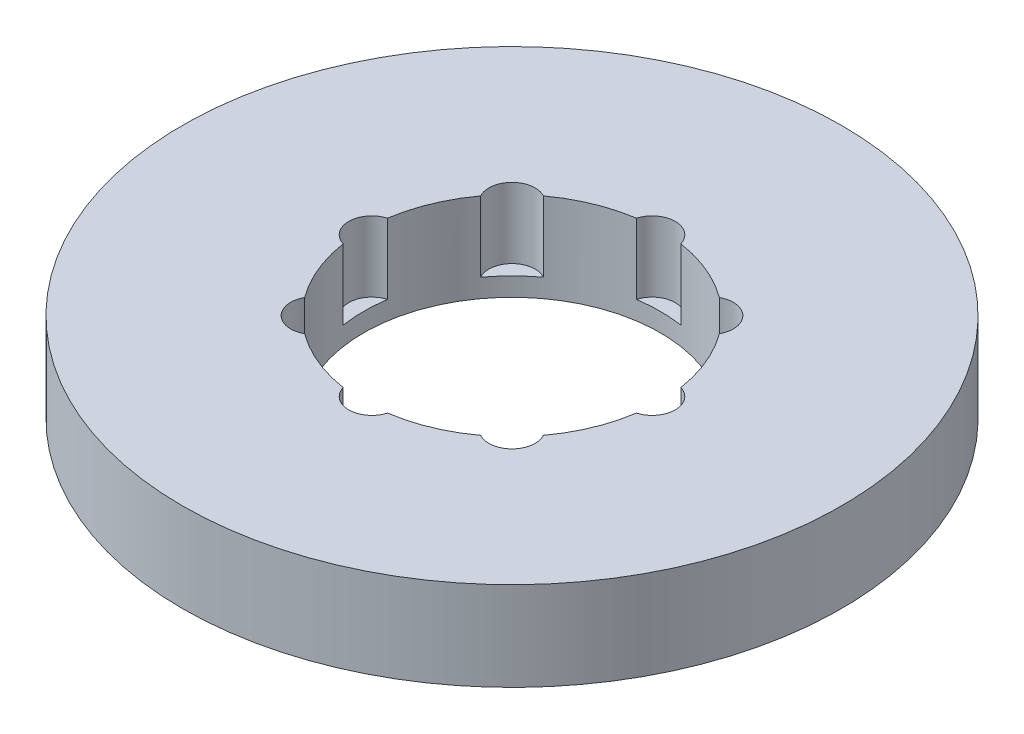
ISO-10303-21;
HEADER;
FILE_DESCRIPTION(('STEP AP214'),'2;1');
FILE_NAME('part.step','',(''),(''),'','','');
FILE_SCHEMA(('AUTOMOTIVE_DESIGN { 1 0 10303 214 1 1 1 1 }'));
ENDSEC;
DATA;
#1=APPLICATION_CONTEXT('core data for automotive mechanical design processes');
#2=APPLICATION_PROTOCOL_DEFINITION('international standard','automotive_design',2000,#1);
#3=PRODUCT_CONTEXT('',#1,'mechanical');
#4=PRODUCT('Part','Part','',(#3));
#5=PRODUCT_RELATED_PRODUCT_CATEGORY('part','',(#4));
#6=PRODUCT_DEFINITION_FORMATION('','',#4);
#7=PRODUCT_DEFINITION_CONTEXT('part definition',#1,'design');
#8=PRODUCT_DEFINITION('design','',#6,#7);
#9=PRODUCT_DEFINITION_SHAPE('','',#8);
#10=(LENGTH_UNIT() NAMED_UNIT(*) SI_UNIT(.MILLI.,.METRE.));
#11=(NAMED_UNIT(*) PLANE_ANGLE_UNIT() SI_UNIT($,.RADIAN.));
#12=(NAMED_UNIT(*) SI_UNIT($,.STERADIAN.) SOLID_ANGLE_UNIT());
#13=UNCERTAINTY_MEASURE_WITH_UNIT(LENGTH_MEASURE(1.E-05),#10,'distance_accuracy_value','');
#14=(GEOMETRIC_REPRESENTATION_CONTEXT(3) GLOBAL_UNCERTAINTY_ASSIGNED_CONTEXT((#13)) GLOBAL_UNIT_ASSIGNED_CONTEXT((#10,
#11,#12)) REPRESENTATION_CONTEXT('',''));
#15=CARTESIAN_POINT('',(0.,0.,0.));
#16=DIRECTION('',(0.,0.,1.));
#17=DIRECTION('',(1.,0.,0.));
#18=AXIS2_PLACEMENT_3D('',#15,#16,#17);
#19=CARTESIAN_POINT('',(0.,27.,0.));
#20=DIRECTION('',(0.,-1.,0.));
#21=DIRECTION('',(0.,0.,-1.));
#22=AXIS2_PLACEMENT_3D('',#19,#20,#21);
#23=CYLINDRICAL_SURFACE('',#22,100.);
#24=CARTESIAN_POINT('',(0.,27.,0.));
#25=DIRECTION('',(0.,1.,0.));
#26=DIRECTION('',(0.,0.,1.));
#27=AXIS2_PLACEMENT_3D('',#24,#25,#26);
#28=CIRCLE('',#27,100.);
#29=CARTESIAN_POINT('',(0.,27.,100.));
#30=VERTEX_POINT('',#29);
#31=EDGE_CURVE('E183',#30,#30,#28,.T.);
#32=ORIENTED_EDGE('',*,*,#31,.F.);
#33=EDGE_LOOP('',(#32));
#34=FACE_BOUND('',#33,.T.);
#35=CARTESIAN_POINT('',(0.,0.,0.));
#36=DIRECTION('',(0.,1.,0.));
#37=DIRECTION('',(0.,0.,1.));
#38=AXIS2_PLACEMENT_3D('',#35,#36,#37);
#39=CIRCLE('',#38,100.);
#40=CARTESIAN_POINT('',(0.,0.,100.));
#41=VERTEX_POINT('',#40);
#42=EDGE_CURVE('E182',#41,#41,#39,.T.);
#43=ORIENTED_EDGE('',*,*,#42,.T.);
#44=EDGE_LOOP('',(#43));
#45=FACE_BOUND('',#44,.T.);
#46=ADVANCED_FACE('F39',(#34,#45),#23,.T.);
#47=CARTESIAN_POINT('',(0.,27.,0.));
#48=DIRECTION('',(0.,1.,0.));
#49=DIRECTION('',(0.,0.,1.));
#50=AXIS2_PLACEMENT_3D('',#47,#48,#49);
#51=PLANE('',#50);
#52=CARTESIAN_POINT('',(1.48472488596847E-13,27.,42.5242108399873));
#53=DIRECTION('',(0.,1.,0.));
#54=DIRECTION('',(1.,0.,0.));
#55=AXIS2_PLACEMENT_3D('',#52,#53,#54);
#56=CIRCLE('',#55,7.01181865421811);
#57=CARTESIAN_POINT('',(-6.72945793609793,27.,44.4939815692672));
#58=VERTEX_POINT('',#57);
#59=CARTESIAN_POINT('',(6.72945793609824,27.,44.4939815692672));
#60=VERTEX_POINT('',#59);
#61=EDGE_CURVE('E256',#58,#60,#56,.T.);
#62=ORIENTED_EDGE('',*,*,#61,.F.);
#63=CARTESIAN_POINT('',(0.,27.,0.));
#64=DIRECTION('',(0.,1.,0.));
#65=DIRECTION('',(0.,0.,1.));
#66=AXIS2_PLACEMENT_3D('',#63,#64,#65);
#67=CIRCLE('',#66,45.);
#68=CARTESIAN_POINT('',(-26.7035507492934,27.,36.2204414299427));
#69=VERTEX_POINT('',#68);
#70=EDGE_CURVE('E175',#69,#58,#67,.T.);
#71=ORIENTED_EDGE('',*,*,#70,.F.);
#72=CARTESIAN_POINT('',(-30.0691578495615,27.,30.0691578495616));
#73=DIRECTION('',(0.,1.,0.));
#74=DIRECTION('',(0.707106781186549,0.,0.707106781186546));
#75=AXIS2_PLACEMENT_3D('',#72,#73,#74);
#76=CIRCLE('',#75,7.01181865421811);
#77=CARTESIAN_POINT('',(-36.2204414299426,27.,26.7035507492936));
#78=VERTEX_POINT('',#77);
#79=EDGE_CURVE('E152',#78,#69,#76,.T.);
#80=ORIENTED_EDGE('',*,*,#79,.F.);
#81=CARTESIAN_POINT('',(-44.4939815692672,27.,6.72945793609808));
#82=VERTEX_POINT('',#81);
#83=EDGE_CURVE('E168',#82,#78,#67,.T.);
#84=ORIENTED_EDGE('',*,*,#83,.F.);
#85=CARTESIAN_POINT('',(-42.5242108399873,27.,0.));
#86=DIRECTION('',(0.,1.,0.));
#87=DIRECTION('',(0.,0.,1.));
#88=AXIS2_PLACEMENT_3D('',#85,#86,#87);
#89=CIRCLE('',#88,7.01181865421811);
#90=CARTESIAN_POINT('',(-44.4939815692672,27.,-6.72945793609808));
#91=VERTEX_POINT('',#90);
#92=EDGE_CURVE('E205',#91,#82,#89,.T.);
#93=ORIENTED_EDGE('',*,*,#92,.F.);
#94=CARTESIAN_POINT('',(-36.220441429943,27.,-26.7035507492931));
#95=VERTEX_POINT('',#94);
#96=EDGE_CURVE('E181',#95,#91,#67,.T.);
#97=ORIENTED_EDGE('',*,*,#96,.F.);
#98=CARTESIAN_POINT('',(-30.0691578495619,27.,-30.0691578495612));
#99=DIRECTION('',(0.,1.,0.));
#100=DIRECTION('',(-0.707106781186539,0.,0.707106781186556));
#101=AXIS2_PLACEMENT_3D('',#98,#99,#100);
#102=CIRCLE('',#101,7.01181865421811);
#103=CARTESIAN_POINT('',(-26.7035507492939,27.,-36.2204414299423));
#104=VERTEX_POINT('',#103);
#105=EDGE_CURVE('E453',#104,#95,#102,.T.);
#106=ORIENTED_EDGE('',*,*,#105,.F.);
#107=CARTESIAN_POINT('',(-6.72945793609855,27.,-44.4939815692671));
#108=VERTEX_POINT('',#107);
#109=EDGE_CURVE('E189',#108,#104,#67,.T.);
#110=ORIENTED_EDGE('',*,*,#109,.F.);
#111=CARTESIAN_POINT('',(-4.4541746579054E-13,27.,-42.5242108399873));
#112=DIRECTION('',(0.,1.,0.));
#113=DIRECTION('',(-1.,0.,0.));
#114=AXIS2_PLACEMENT_3D('',#111,#112,#113);
#115=CIRCLE('',#114,7.01181865421811);
#116=CARTESIAN_POINT('',(6.72945793609762,27.,-44.4939815692672));
#117=VERTEX_POINT('',#116);
#118=EDGE_CURVE('E462',#117,#108,#115,.T.);
#119=ORIENTED_EDGE('',*,*,#118,.F.);
#120=CARTESIAN_POINT('',(26.7035507492932,27.,-36.2204414299429));
#121=VERTEX_POINT('',#120);
#122=EDGE_CURVE('E197',#121,#117,#67,.T.);
#123=ORIENTED_EDGE('',*,*,#122,.F.);
#124=CARTESIAN_POINT('',(30.0691578495613,27.,-30.0691578495618));
#125=DIRECTION('',(0.,1.,0.));
#126=DIRECTION('',(-0.707106781186554,0.,-0.707106781186541));
#127=AXIS2_PLACEMENT_3D('',#124,#125,#126);
#128=CIRCLE('',#127,7.01181865421811);
#129=CARTESIAN_POINT('',(36.2204414299424,27.,-26.7035507492938));
#130=VERTEX_POINT('',#129);
#131=EDGE_CURVE('E470',#130,#121,#128,.T.);
#132=ORIENTED_EDGE('',*,*,#131,.F.);
#133=CARTESIAN_POINT('',(44.4939815692672,27.,-6.72945793609808));
#134=VERTEX_POINT('',#133);
#135=EDGE_CURVE('E489',#134,#130,#67,.T.);
#136=ORIENTED_EDGE('',*,*,#135,.F.);
#137=CARTESIAN_POINT('',(42.5242108399873,27.,0.));
#138=DIRECTION('',(0.,1.,0.));
#139=DIRECTION('',(0.,0.,-1.));
#140=AXIS2_PLACEMENT_3D('',#137,#138,#139);
#141=CIRCLE('',#140,7.01181865421811);
#142=CARTESIAN_POINT('',(44.4939815692672,27.,6.72945793609808));
#143=VERTEX_POINT('',#142);
#144=EDGE_CURVE('E476',#143,#134,#141,.T.);
#145=ORIENTED_EDGE('',*,*,#144,.F.);
#146=CARTESIAN_POINT('',(36.2204414299428,27.,26.7035507492933));
#147=VERTEX_POINT('',#146);
#148=EDGE_CURVE('E491',#147,#143,#67,.T.);
#149=ORIENTED_EDGE('',*,*,#148,.F.);
#150=CARTESIAN_POINT('',(30.0691578495617,27.,30.0691578495614));
#151=DIRECTION('',(0.,1.,0.));
#152=DIRECTION('',(0.707106781186544,0.,-0.707106781186551));
#153=AXIS2_PLACEMENT_3D('',#150,#151,#152);
#154=CIRCLE('',#153,7.01181865421811);
#155=CARTESIAN_POINT('',(26.7035507492937,27.,36.2204414299425));
#156=VERTEX_POINT('',#155);
#157=EDGE_CURVE('E475',#156,#147,#154,.T.);
#158=ORIENTED_EDGE('',*,*,#157,.F.);
#159=EDGE_CURVE('E190',#60,#156,#67,.T.);
#160=ORIENTED_EDGE('',*,*,#159,.F.);
#161=EDGE_LOOP('',(#62,#71,#80,#84,#93,#97,#106,#110,#119,#123,#132,#136,#145,#149,#158,#160));
#162=FACE_BOUND('',#161,.T.);
#163=ORIENTED_EDGE('',*,*,#31,.T.);
#164=EDGE_LOOP('',(#163));
#165=FACE_BOUND('',#164,.T.);
#166=ADVANCED_FACE('F170',(#162,#165),#51,.T.);
#167=CARTESIAN_POINT('',(0.,0.,0.));
#168=DIRECTION('',(0.,1.,0.));
#169=DIRECTION('',(0.,0.,1.));
#170=AXIS2_PLACEMENT_3D('',#167,#168,#169);
#171=PLANE('',#170);
#172=CARTESIAN_POINT('',(0.,0.,0.));
#173=DIRECTION('',(0.,1.,0.));
#174=DIRECTION('',(0.,0.,1.));
#175=AXIS2_PLACEMENT_3D('',#172,#173,#174);
#176=CIRCLE('',#175,45.);
#177=CARTESIAN_POINT('',(0.,0.,45.));
#178=VERTEX_POINT('',#177);
#179=EDGE_CURVE('E191',#178,#178,#176,.T.);
#180=ORIENTED_EDGE('',*,*,#179,.T.);
#181=EDGE_LOOP('',(#180));
#182=FACE_BOUND('',#181,.T.);
#183=ORIENTED_EDGE('',*,*,#42,.F.);
#184=EDGE_LOOP('',(#183));
#185=FACE_BOUND('',#184,.T.);
#186=ADVANCED_FACE('F277',(#182,#185),#171,.F.);
#187=CARTESIAN_POINT('',(0.,27.,0.));
#188=DIRECTION('',(0.,-1.,0.));
#189=DIRECTION('',(0.,0.,-1.));
#190=AXIS2_PLACEMENT_3D('',#187,#188,#189);
#191=CYLINDRICAL_SURFACE('',#190,45.);
#192=DIRECTION('',(0.,1.,0.));
#193=VECTOR('',#192,1.);
#194=CARTESIAN_POINT('',(-6.72945793609792,16.3238527221255,44.4939815692672));
#195=LINE('',#194,#193);
#196=CARTESIAN_POINT('',(-6.72945793609793,5.64770544425091,44.4939815692672));
#197=VERTEX_POINT('',#196);
#198=EDGE_CURVE('E11',#197,#58,#195,.T.);
#199=ORIENTED_EDGE('',*,*,#198,.F.);
#200=CARTESIAN_POINT('',(0.,5.64770544425091,0.));
#201=DIRECTION('',(0.,1.,0.));
#202=DIRECTION('',(0.,0.,1.));
#203=AXIS2_PLACEMENT_3D('',#200,#201,#202);
#204=CIRCLE('',#203,45.);
#205=CARTESIAN_POINT('',(6.72945793609824,5.64770544425091,44.4939815692672));
#206=VERTEX_POINT('',#205);
#207=EDGE_CURVE('E251',#197,#206,#204,.T.);
#208=ORIENTED_EDGE('',*,*,#207,.T.);
#209=DIRECTION('',(0.,1.,0.));
#210=VECTOR('',#209,1.);
#211=CARTESIAN_POINT('',(6.72945793609823,16.3238527221255,44.4939815692672));
#212=LINE('',#211,#210);
#213=EDGE_CURVE('E46',#60,#206,#212,.F.);
#214=ORIENTED_EDGE('',*,*,#213,.F.);
#215=ORIENTED_EDGE('',*,*,#159,.T.);
#216=DIRECTION('',(0.,1.,0.));
#217=VECTOR('',#216,1.);
#218=CARTESIAN_POINT('',(26.7035507492937,16.3238527221255,36.2204414299425));
#219=LINE('',#218,#217);
#220=CARTESIAN_POINT('',(26.7035507492937,5.64770544425091,36.2204414299425));
#221=VERTEX_POINT('',#220);
#222=EDGE_CURVE('E253',#221,#156,#219,.T.);
#223=ORIENTED_EDGE('',*,*,#222,.F.);
#224=CARTESIAN_POINT('',(0.,5.64770544425091,0.));
#225=DIRECTION('',(0.,1.,0.));
#226=DIRECTION('',(0.,0.,1.));
#227=AXIS2_PLACEMENT_3D('',#224,#225,#226);
#228=CIRCLE('',#227,45.);
#229=CARTESIAN_POINT('',(36.2204414299428,5.64770544425091,26.7035507492933));
#230=VERTEX_POINT('',#229);
#231=EDGE_CURVE('E246',#221,#230,#228,.T.);
#232=ORIENTED_EDGE('',*,*,#231,.T.);
#233=DIRECTION('',(0.,1.,0.));
#234=VECTOR('',#233,1.);
#235=CARTESIAN_POINT('',(36.2204414299428,16.3238527221255,26.7035507492933));
#236=LINE('',#235,#234);
#237=EDGE_CURVE('E248',#147,#230,#236,.F.);
#238=ORIENTED_EDGE('',*,*,#237,.F.);
#239=ORIENTED_EDGE('',*,*,#148,.T.);
#240=DIRECTION('',(0.,1.,0.));
#241=VECTOR('',#240,1.);
#242=CARTESIAN_POINT('',(44.4939815692672,16.3238527221255,6.72945793609808));
#243=LINE('',#242,#241);
#244=CARTESIAN_POINT('',(44.4939815692672,5.64770544425091,6.72945793609808));
#245=VERTEX_POINT('',#244);
#246=EDGE_CURVE('E243',#245,#143,#243,.T.);
#247=ORIENTED_EDGE('',*,*,#246,.F.);
#248=CARTESIAN_POINT('',(0.,5.64770544425091,0.));
#249=DIRECTION('',(0.,1.,0.));
#250=DIRECTION('',(0.,0.,1.));
#251=AXIS2_PLACEMENT_3D('',#248,#249,#250);
#252=CIRCLE('',#251,45.);
#253=CARTESIAN_POINT('',(44.4939815692672,5.64770544425091,-6.72945793609808));
#254=VERTEX_POINT('',#253);
#255=EDGE_CURVE('E236',#245,#254,#252,.T.);
#256=ORIENTED_EDGE('',*,*,#255,.T.);
#257=DIRECTION('',(0.,1.,0.));
#258=VECTOR('',#257,1.);
#259=CARTESIAN_POINT('',(44.4939815692672,16.3238527221255,-6.72945793609808));
#260=LINE('',#259,#258);
#261=EDGE_CURVE('E241',#134,#254,#260,.F.);
#262=ORIENTED_EDGE('',*,*,#261,.F.);
#263=ORIENTED_EDGE('',*,*,#135,.T.);
#264=DIRECTION('',(0.,1.,0.));
#265=VECTOR('',#264,1.);
#266=CARTESIAN_POINT('',(36.2204414299424,16.3238527221255,-26.7035507492938));
#267=LINE('',#266,#265);
#268=CARTESIAN_POINT('',(36.2204414299424,5.64770544425091,-26.7035507492938));
#269=VERTEX_POINT('',#268);
#270=EDGE_CURVE('E237',#269,#130,#267,.T.);
#271=ORIENTED_EDGE('',*,*,#270,.F.);
#272=CARTESIAN_POINT('',(0.,5.64770544425091,0.));
#273=DIRECTION('',(0.,1.,0.));
#274=DIRECTION('',(0.,0.,1.));
#275=AXIS2_PLACEMENT_3D('',#272,#273,#274);
#276=CIRCLE('',#275,45.);
#277=CARTESIAN_POINT('',(26.7035507492932,5.64770544425091,-36.2204414299429));
#278=VERTEX_POINT('',#277);
#279=EDGE_CURVE('E229',#269,#278,#276,.T.);
#280=ORIENTED_EDGE('',*,*,#279,.T.);
#281=DIRECTION('',(0.,1.,0.));
#282=VECTOR('',#281,1.);
#283=CARTESIAN_POINT('',(26.7035507492932,16.3238527221255,-36.2204414299429));
#284=LINE('',#283,#282);
#285=EDGE_CURVE('E232',#121,#278,#284,.F.);
#286=ORIENTED_EDGE('',*,*,#285,.F.);
#287=ORIENTED_EDGE('',*,*,#122,.T.);
#288=DIRECTION('',(0.,1.,0.));
#289=VECTOR('',#288,1.);
#290=CARTESIAN_POINT('',(6.72945793609762,16.3238527221255,-44.4939815692672));
#291=LINE('',#290,#289);
#292=CARTESIAN_POINT('',(6.72945793609762,5.64770544425091,-44.4939815692672));
#293=VERTEX_POINT('',#292);
#294=EDGE_CURVE('E227',#293,#117,#291,.T.);
#295=ORIENTED_EDGE('',*,*,#294,.F.);
#296=CARTESIAN_POINT('',(0.,5.64770544425091,0.));
#297=DIRECTION('',(0.,1.,0.));
#298=DIRECTION('',(0.,0.,1.));
#299=AXIS2_PLACEMENT_3D('',#296,#297,#298);
#300=CIRCLE('',#299,45.);
#301=CARTESIAN_POINT('',(-6.72945793609855,5.64770544425091,-44.4939815692671));
#302=VERTEX_POINT('',#301);
#303=EDGE_CURVE('E225',#293,#302,#300,.T.);
#304=ORIENTED_EDGE('',*,*,#303,.T.);
#305=DIRECTION('',(0.,1.,0.));
#306=VECTOR('',#305,1.);
#307=CARTESIAN_POINT('',(-6.72945793609855,16.3238527221255,-44.4939815692671));
#308=LINE('',#307,#306);
#309=EDGE_CURVE('E223',#108,#302,#308,.F.);
#310=ORIENTED_EDGE('',*,*,#309,.F.);
#311=ORIENTED_EDGE('',*,*,#109,.T.);
#312=DIRECTION('',(0.,1.,0.));
#313=VECTOR('',#312,1.);
#314=CARTESIAN_POINT('',(-26.703550749294,16.3238527221255,-36.2204414299424));
#315=LINE('',#314,#313);
#316=CARTESIAN_POINT('',(-26.7035507492939,5.64770544425091,-36.2204414299423));
#317=VERTEX_POINT('',#316);
#318=EDGE_CURVE('E219',#317,#104,#315,.T.);
#319=ORIENTED_EDGE('',*,*,#318,.F.);
#320=CARTESIAN_POINT('',(0.,5.64770544425091,0.));
#321=DIRECTION('',(0.,1.,0.));
#322=DIRECTION('',(0.,0.,1.));
#323=AXIS2_PLACEMENT_3D('',#320,#321,#322);
#324=CIRCLE('',#323,45.);
#325=CARTESIAN_POINT('',(-36.220441429943,5.64770544425091,-26.7035507492931));
#326=VERTEX_POINT('',#325);
#327=EDGE_CURVE('E159',#317,#326,#324,.T.);
#328=ORIENTED_EDGE('',*,*,#327,.T.);
#329=DIRECTION('',(0.,1.,0.));
#330=VECTOR('',#329,1.);
#331=CARTESIAN_POINT('',(-36.220441429943,16.3238527221255,-26.7035507492931));
#332=LINE('',#331,#330);
#333=EDGE_CURVE('E220',#95,#326,#332,.F.);
#334=ORIENTED_EDGE('',*,*,#333,.F.);
#335=ORIENTED_EDGE('',*,*,#96,.T.);
#336=DIRECTION('',(0.,1.,0.));
#337=VECTOR('',#336,1.);
#338=CARTESIAN_POINT('',(-44.4939815692672,16.3238527221255,-6.72945793609808));
#339=LINE('',#338,#337);
#340=CARTESIAN_POINT('',(-44.4939815692672,5.64770544425091,-6.72945793609808));
#341=VERTEX_POINT('',#340);
#342=EDGE_CURVE('E209',#341,#91,#339,.T.);
#343=ORIENTED_EDGE('',*,*,#342,.F.);
#344=CARTESIAN_POINT('',(0.,5.64770544425091,0.));
#345=DIRECTION('',(0.,1.,0.));
#346=DIRECTION('',(0.,0.,1.));
#347=AXIS2_PLACEMENT_3D('',#344,#345,#346);
#348=CIRCLE('',#347,45.);
#349=CARTESIAN_POINT('',(-44.4939815692672,5.64770544425091,6.72945793609808));
#350=VERTEX_POINT('',#349);
#351=EDGE_CURVE('E206',#341,#350,#348,.T.);
#352=ORIENTED_EDGE('',*,*,#351,.T.);
#353=DIRECTION('',(0.,1.,0.));
#354=VECTOR('',#353,1.);
#355=CARTESIAN_POINT('',(-44.4939815692672,16.3238527221255,6.72945793609808));
#356=LINE('',#355,#354);
#357=EDGE_CURVE('E179',#82,#350,#356,.F.);
#358=ORIENTED_EDGE('',*,*,#357,.F.);
#359=ORIENTED_EDGE('',*,*,#83,.T.);
#360=DIRECTION('',(0.,1.,0.));
#361=VECTOR('',#360,1.);
#362=CARTESIAN_POINT('',(-36.2204414299426,16.3238527221255,26.7035507492936));
#363=LINE('',#362,#361);
#364=CARTESIAN_POINT('',(-36.2204414299426,5.64770544425091,26.7035507492936));
#365=VERTEX_POINT('',#364);
#366=EDGE_CURVE('E147',#365,#78,#363,.T.);
#367=ORIENTED_EDGE('',*,*,#366,.F.);
#368=CARTESIAN_POINT('',(0.,5.64770544425091,0.));
#369=DIRECTION('',(0.,1.,0.));
#370=DIRECTION('',(0.,0.,1.));
#371=AXIS2_PLACEMENT_3D('',#368,#369,#370);
#372=CIRCLE('',#371,45.);
#373=CARTESIAN_POINT('',(-26.7035507492934,5.64770544425091,36.2204414299427));
#374=VERTEX_POINT('',#373);
#375=EDGE_CURVE('E215',#365,#374,#372,.T.);
#376=ORIENTED_EDGE('',*,*,#375,.T.);
#377=DIRECTION('',(0.,1.,0.));
#378=VECTOR('',#377,1.);
#379=CARTESIAN_POINT('',(-26.7035507492934,16.3238527221255,36.2204414299427));
#380=LINE('',#379,#378);
#381=EDGE_CURVE('E161',#69,#374,#380,.F.);
#382=ORIENTED_EDGE('',*,*,#381,.F.);
#383=ORIENTED_EDGE('',*,*,#70,.T.);
#384=EDGE_LOOP('',(#199,#208,#214,#215,#223,#232,#238,#239,#247,#256,#262,#263,#271,#280,#286,
#287,#295,#304,#310,#311,#319,#328,#334,#335,#343,#352,#358,#359,#367,#376,#382,#383));
#385=FACE_BOUND('',#384,.T.);
#386=ORIENTED_EDGE('',*,*,#179,.F.);
#387=EDGE_LOOP('',(#386));
#388=FACE_BOUND('',#387,.T.);
#389=ADVANCED_FACE('F176',(#385,#388),#191,.F.);
#390=CARTESIAN_POINT('',(-42.5242108399873,5.64770544425091,0.));
#391=DIRECTION('',(0.,1.,0.));
#392=DIRECTION('',(0.,0.,1.));
#393=AXIS2_PLACEMENT_3D('',#390,#391,#392);
#394=CYLINDRICAL_SURFACE('',#393,7.01181865421811);
#395=ORIENTED_EDGE('',*,*,#342,.T.);
#396=ORIENTED_EDGE('',*,*,#92,.T.);
#397=ORIENTED_EDGE('',*,*,#357,.T.);
#398=CARTESIAN_POINT('',(-42.5242108399873,5.64770544425091,0.));
#399=DIRECTION('',(0.,1.,0.));
#400=DIRECTION('',(0.,0.,1.));
#401=AXIS2_PLACEMENT_3D('',#398,#399,#400);
#402=CIRCLE('',#401,7.01181865421811);
#403=EDGE_CURVE('E200',#341,#350,#402,.T.);
#404=ORIENTED_EDGE('',*,*,#403,.F.);
#405=EDGE_LOOP('',(#395,#396,#397,#404));
#406=FACE_BOUND('',#405,.T.);
#407=ADVANCED_FACE('F286',(#406),#394,.F.);
#408=CARTESIAN_POINT('',(-42.5242108399873,5.64770544425091,0.));
#409=DIRECTION('',(0.,1.,0.));
#410=DIRECTION('',(0.,0.,1.));
#411=AXIS2_PLACEMENT_3D('',#408,#409,#410);
#412=PLANE('',#411);
#413=ORIENTED_EDGE('',*,*,#403,.T.);
#414=ORIENTED_EDGE('',*,*,#351,.F.);
#415=EDGE_LOOP('',(#413,#414));
#416=FACE_BOUND('',#415,.T.);
#417=ADVANCED_FACE('F289',(#416),#412,.T.);
#418=CARTESIAN_POINT('',(-30.0691578495615,5.64770544425091,30.0691578495616));
#419=DIRECTION('',(0.,1.,0.));
#420=DIRECTION('',(0.,0.,1.));
#421=AXIS2_PLACEMENT_3D('',#418,#419,#420);
#422=CYLINDRICAL_SURFACE('',#421,7.01181865421811);
#423=ORIENTED_EDGE('',*,*,#366,.T.);
#424=ORIENTED_EDGE('',*,*,#79,.T.);
#425=ORIENTED_EDGE('',*,*,#381,.T.);
#426=CARTESIAN_POINT('',(-30.0691578495615,5.64770544425091,30.0691578495616));
#427=DIRECTION('',(0.,1.,0.));
#428=DIRECTION('',(0.707106781186549,0.,0.707106781186546));
#429=AXIS2_PLACEMENT_3D('',#426,#427,#428);
#430=CIRCLE('',#429,7.01181865421811);
#431=EDGE_CURVE('E156',#365,#374,#430,.T.);
#432=ORIENTED_EDGE('',*,*,#431,.F.);
#433=EDGE_LOOP('',(#423,#424,#425,#432));
#434=FACE_BOUND('',#433,.T.);
#435=ADVANCED_FACE('F155',(#434),#422,.F.);
#436=CARTESIAN_POINT('',(-30.0691578495615,5.64770544425091,30.0691578495616));
#437=DIRECTION('',(0.,1.,0.));
#438=DIRECTION('',(0.707106781186549,0.,0.707106781186546));
#439=AXIS2_PLACEMENT_3D('',#436,#437,#438);
#440=PLANE('',#439);
#441=ORIENTED_EDGE('',*,*,#431,.T.);
#442=ORIENTED_EDGE('',*,*,#375,.F.);
#443=EDGE_LOOP('',(#441,#442));
#444=FACE_BOUND('',#443,.T.);
#445=ADVANCED_FACE('F300',(#444),#440,.T.);
#446=CARTESIAN_POINT('',(-30.0691578495619,5.64770544425091,-30.0691578495612));
#447=DIRECTION('',(0.,1.,0.));
#448=DIRECTION('',(0.,0.,1.));
#449=AXIS2_PLACEMENT_3D('',#446,#447,#448);
#450=CYLINDRICAL_SURFACE('',#449,7.01181865421811);
#451=ORIENTED_EDGE('',*,*,#318,.T.);
#452=ORIENTED_EDGE('',*,*,#105,.T.);
#453=ORIENTED_EDGE('',*,*,#333,.T.);
#454=CARTESIAN_POINT('',(-30.0691578495619,5.64770544425091,-30.0691578495612));
#455=DIRECTION('',(0.,1.,0.));
#456=DIRECTION('',(-0.707106781186539,0.,0.707106781186556));
#457=AXIS2_PLACEMENT_3D('',#454,#455,#456);
#458=CIRCLE('',#457,7.01181865421811);
#459=EDGE_CURVE('E454',#317,#326,#458,.T.);
#460=ORIENTED_EDGE('',*,*,#459,.F.);
#461=EDGE_LOOP('',(#451,#452,#453,#460));
#462=FACE_BOUND('',#461,.T.);
#463=ADVANCED_FACE('F299',(#462),#450,.F.);
#464=CARTESIAN_POINT('',(-30.0691578495619,5.64770544425091,-30.0691578495612));
#465=DIRECTION('',(0.,1.,0.));
#466=DIRECTION('',(-0.707106781186539,0.,0.707106781186556));
#467=AXIS2_PLACEMENT_3D('',#464,#465,#466);
#468=PLANE('',#467);
#469=ORIENTED_EDGE('',*,*,#459,.T.);
#470=ORIENTED_EDGE('',*,*,#327,.F.);
#471=EDGE_LOOP('',(#469,#470));
#472=FACE_BOUND('',#471,.T.);
#473=ADVANCED_FACE('F379',(#472),#468,.T.);
#474=CARTESIAN_POINT('',(-4.4541746579054E-13,5.64770544425091,-42.5242108399873));
#475=DIRECTION('',(0.,1.,0.));
#476=DIRECTION('',(0.,0.,1.));
#477=AXIS2_PLACEMENT_3D('',#474,#475,#476);
#478=CYLINDRICAL_SURFACE('',#477,7.01181865421811);
#479=ORIENTED_EDGE('',*,*,#294,.T.);
#480=ORIENTED_EDGE('',*,*,#118,.T.);
#481=ORIENTED_EDGE('',*,*,#309,.T.);
#482=CARTESIAN_POINT('',(-4.4541746579054E-13,5.64770544425091,-42.5242108399873));
#483=DIRECTION('',(0.,1.,0.));
#484=DIRECTION('',(-1.,0.,0.));
#485=AXIS2_PLACEMENT_3D('',#482,#483,#484);
#486=CIRCLE('',#485,7.01181865421811);
#487=EDGE_CURVE('E465',#293,#302,#486,.T.);
#488=ORIENTED_EDGE('',*,*,#487,.F.);
#489=EDGE_LOOP('',(#479,#480,#481,#488));
#490=FACE_BOUND('',#489,.T.);
#491=ADVANCED_FACE('F371',(#490),#478,.F.);
#492=CARTESIAN_POINT('',(-4.4541746579054E-13,5.64770544425091,-42.5242108399873));
#493=DIRECTION('',(0.,1.,0.));
#494=DIRECTION('',(-1.,0.,0.));
#495=AXIS2_PLACEMENT_3D('',#492,#493,#494);
#496=PLANE('',#495);
#497=ORIENTED_EDGE('',*,*,#487,.T.);
#498=ORIENTED_EDGE('',*,*,#303,.F.);
#499=EDGE_LOOP('',(#497,#498));
#500=FACE_BOUND('',#499,.T.);
#501=ADVANCED_FACE('F308',(#500),#496,.T.);
#502=CARTESIAN_POINT('',(30.0691578495613,5.64770544425091,-30.0691578495618));
#503=DIRECTION('',(0.,1.,0.));
#504=DIRECTION('',(0.,0.,1.));
#505=AXIS2_PLACEMENT_3D('',#502,#503,#504);
#506=CYLINDRICAL_SURFACE('',#505,7.01181865421811);
#507=ORIENTED_EDGE('',*,*,#270,.T.);
#508=ORIENTED_EDGE('',*,*,#131,.T.);
#509=ORIENTED_EDGE('',*,*,#285,.T.);
#510=CARTESIAN_POINT('',(30.0691578495613,5.64770544425091,-30.0691578495618));
#511=DIRECTION('',(0.,1.,0.));
#512=DIRECTION('',(-0.707106781186554,0.,-0.707106781186541));
#513=AXIS2_PLACEMENT_3D('',#510,#511,#512);
#514=CIRCLE('',#513,7.01181865421811);
#515=EDGE_CURVE('E477',#269,#278,#514,.T.);
#516=ORIENTED_EDGE('',*,*,#515,.F.);
#517=EDGE_LOOP('',(#507,#508,#509,#516));
#518=FACE_BOUND('',#517,.T.);
#519=ADVANCED_FACE('F305',(#518),#506,.F.);
#520=CARTESIAN_POINT('',(30.0691578495613,5.64770544425091,-30.0691578495618));
#521=DIRECTION('',(0.,1.,0.));
#522=DIRECTION('',(-0.707106781186554,0.,-0.707106781186541));
#523=AXIS2_PLACEMENT_3D('',#520,#521,#522);
#524=PLANE('',#523);
#525=ORIENTED_EDGE('',*,*,#515,.T.);
#526=ORIENTED_EDGE('',*,*,#279,.F.);
#527=EDGE_LOOP('',(#525,#526));
#528=FACE_BOUND('',#527,.T.);
#529=ADVANCED_FACE('F304',(#528),#524,.T.);
#530=CARTESIAN_POINT('',(42.5242108399873,5.64770544425091,0.));
#531=DIRECTION('',(0.,1.,0.));
#532=DIRECTION('',(0.,0.,1.));
#533=AXIS2_PLACEMENT_3D('',#530,#531,#532);
#534=CYLINDRICAL_SURFACE('',#533,7.01181865421811);
#535=ORIENTED_EDGE('',*,*,#246,.T.);
#536=ORIENTED_EDGE('',*,*,#144,.T.);
#537=ORIENTED_EDGE('',*,*,#261,.T.);
#538=CARTESIAN_POINT('',(42.5242108399873,5.64770544425091,0.));
#539=DIRECTION('',(0.,1.,0.));
#540=DIRECTION('',(0.,0.,-1.));
#541=AXIS2_PLACEMENT_3D('',#538,#539,#540);
#542=CIRCLE('',#541,7.01181865421811);
#543=EDGE_CURVE('E478',#245,#254,#542,.T.);
#544=ORIENTED_EDGE('',*,*,#543,.F.);
#545=EDGE_LOOP('',(#535,#536,#537,#544));
#546=FACE_BOUND('',#545,.T.);
#547=ADVANCED_FACE('F309',(#546),#534,.F.);
#548=CARTESIAN_POINT('',(42.5242108399873,5.64770544425091,0.));
#549=DIRECTION('',(0.,1.,0.));
#550=DIRECTION('',(0.,0.,-1.));
#551=AXIS2_PLACEMENT_3D('',#548,#549,#550);
#552=PLANE('',#551);
#553=ORIENTED_EDGE('',*,*,#543,.T.);
#554=ORIENTED_EDGE('',*,*,#255,.F.);
#555=EDGE_LOOP('',(#553,#554));
#556=FACE_BOUND('',#555,.T.);
#557=ADVANCED_FACE('F314',(#556),#552,.T.);
#558=CARTESIAN_POINT('',(30.0691578495617,5.64770544425091,30.0691578495614));
#559=DIRECTION('',(0.,1.,0.));
#560=DIRECTION('',(0.,0.,1.));
#561=AXIS2_PLACEMENT_3D('',#558,#559,#560);
#562=CYLINDRICAL_SURFACE('',#561,7.01181865421811);
#563=ORIENTED_EDGE('',*,*,#222,.T.);
#564=ORIENTED_EDGE('',*,*,#157,.T.);
#565=ORIENTED_EDGE('',*,*,#237,.T.);
#566=CARTESIAN_POINT('',(30.0691578495617,5.64770544425091,30.0691578495614));
#567=DIRECTION('',(0.,1.,0.));
#568=DIRECTION('',(0.707106781186544,0.,-0.707106781186551));
#569=AXIS2_PLACEMENT_3D('',#566,#567,#568);
#570=CIRCLE('',#569,7.01181865421811);
#571=EDGE_CURVE('E56',#221,#230,#570,.T.);
#572=ORIENTED_EDGE('',*,*,#571,.F.);
#573=EDGE_LOOP('',(#563,#564,#565,#572));
#574=FACE_BOUND('',#573,.T.);
#575=ADVANCED_FACE('F318',(#574),#562,.F.);
#576=CARTESIAN_POINT('',(30.0691578495617,5.64770544425091,30.0691578495614));
#577=DIRECTION('',(0.,1.,0.));
#578=DIRECTION('',(0.707106781186544,0.,-0.707106781186551));
#579=AXIS2_PLACEMENT_3D('',#576,#577,#578);
#580=PLANE('',#579);
#581=ORIENTED_EDGE('',*,*,#571,.T.);
#582=ORIENTED_EDGE('',*,*,#231,.F.);
#583=EDGE_LOOP('',(#581,#582));
#584=FACE_BOUND('',#583,.T.);
#585=ADVANCED_FACE('F270',(#584),#580,.T.);
#586=CARTESIAN_POINT('',(1.48472488596847E-13,5.64770544425091,42.5242108399873));
#587=DIRECTION('',(0.,1.,0.));
#588=DIRECTION('',(0.,0.,1.));
#589=AXIS2_PLACEMENT_3D('',#586,#587,#588);
#590=CYLINDRICAL_SURFACE('',#589,7.01181865421811);
#591=ORIENTED_EDGE('',*,*,#198,.T.);
#592=ORIENTED_EDGE('',*,*,#61,.T.);
#593=ORIENTED_EDGE('',*,*,#213,.T.);
#594=CARTESIAN_POINT('',(1.48472488596847E-13,5.64770544425091,42.5242108399873));
#595=DIRECTION('',(0.,1.,0.));
#596=DIRECTION('',(1.,0.,0.));
#597=AXIS2_PLACEMENT_3D('',#594,#595,#596);
#598=CIRCLE('',#597,7.01181865421811);
#599=EDGE_CURVE('E55',#197,#206,#598,.T.);
#600=ORIENTED_EDGE('',*,*,#599,.F.);
#601=EDGE_LOOP('',(#591,#592,#593,#600));
#602=FACE_BOUND('',#601,.T.);
#603=ADVANCED_FACE('F260',(#602),#590,.F.);
#604=CARTESIAN_POINT('',(1.48472488596847E-13,5.64770544425091,42.5242108399873));
#605=DIRECTION('',(0.,1.,0.));
#606=DIRECTION('',(1.,0.,0.));
#607=AXIS2_PLACEMENT_3D('',#604,#605,#606);
#608=PLANE('',#607);
#609=ORIENTED_EDGE('',*,*,#599,.T.);
#610=ORIENTED_EDGE('',*,*,#207,.F.);
#611=EDGE_LOOP('',(#609,#610));
#612=FACE_BOUND('',#611,.T.);
#613=ADVANCED_FACE('F261',(#612),#608,.T.);
#614=CLOSED_SHELL('',(#46,#166,#186,#389,#407,#417,#435,#445,#463,#473,#491,#501,#519,#529,#547,
#557,#575,#585,#603,#613));
#615=MANIFOLD_SOLID_BREP('B2',#614);
#616=ADVANCED_BREP_SHAPE_REPRESENTATION('',(#18,#615),#14);
#617=SHAPE_DEFINITION_REPRESENTATION(#9,#616);
ENDSEC;
END-ISO-10303-21;
